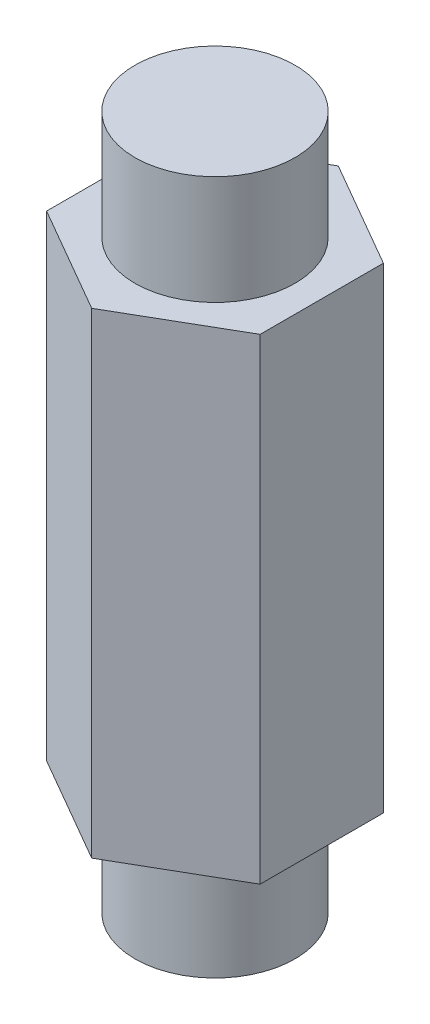
ISO-10303-21;
HEADER;
FILE_DESCRIPTION(('STEP AP214'),'2;1');
FILE_NAME('part.step','',(''),(''),'','','');
FILE_SCHEMA(('AUTOMOTIVE_DESIGN { 1 0 10303 214 1 1 1 1 }'));
ENDSEC;
DATA;
#1=APPLICATION_CONTEXT('core data for automotive mechanical design processes');
#2=APPLICATION_PROTOCOL_DEFINITION('international standard','automotive_design',2000,#1);
#3=PRODUCT_CONTEXT('',#1,'mechanical');
#4=PRODUCT('Part','Part','',(#3));
#5=PRODUCT_RELATED_PRODUCT_CATEGORY('part','',(#4));
#6=PRODUCT_DEFINITION_FORMATION('','',#4);
#7=PRODUCT_DEFINITION_CONTEXT('part definition',#1,'design');
#8=PRODUCT_DEFINITION('design','',#6,#7);
#9=PRODUCT_DEFINITION_SHAPE('','',#8);
#10=(LENGTH_UNIT() NAMED_UNIT(*) SI_UNIT(.MILLI.,.METRE.));
#11=(NAMED_UNIT(*) PLANE_ANGLE_UNIT() SI_UNIT($,.RADIAN.));
#12=(NAMED_UNIT(*) SI_UNIT($,.STERADIAN.) SOLID_ANGLE_UNIT());
#13=UNCERTAINTY_MEASURE_WITH_UNIT(LENGTH_MEASURE(1.E-05),#10,'distance_accuracy_value','');
#14=(GEOMETRIC_REPRESENTATION_CONTEXT(3) GLOBAL_UNCERTAINTY_ASSIGNED_CONTEXT((#13)) GLOBAL_UNIT_ASSIGNED_CONTEXT((#10,
#11,#12)) REPRESENTATION_CONTEXT('',''));
#15=CARTESIAN_POINT('',(0.,0.,0.));
#16=DIRECTION('',(0.,0.,1.));
#17=DIRECTION('',(1.,0.,0.));
#18=AXIS2_PLACEMENT_3D('',#15,#16,#17);
#19=CARTESIAN_POINT('',(0.,14.1605,7.33234841870825));
#20=DIRECTION('',(-0.5,0.,-0.866025403784439));
#21=DIRECTION('',(-0.866025403784439,0.,0.5));
#22=AXIS2_PLACEMENT_3D('',#19,#20,#21);
#23=PLANE('',#22);
#24=DIRECTION('',(0.866025403784438,0.,-0.5));
#25=VECTOR('',#24,1.);
#26=CARTESIAN_POINT('',(0.,-14.1605,7.33234841870825));
#27=LINE('',#26,#25);
#28=CARTESIAN_POINT('',(0.,-14.1605,7.33234841870825));
#29=VERTEX_POINT('',#28);
#30=CARTESIAN_POINT('',(6.35,-14.1605,3.66617420935412));
#31=VERTEX_POINT('',#30);
#32=EDGE_CURVE('E118',#29,#31,#27,.T.);
#33=ORIENTED_EDGE('',*,*,#32,.T.);
#34=DIRECTION('',(0.,-1.,0.));
#35=VECTOR('',#34,1.);
#36=CARTESIAN_POINT('',(6.35,14.1605,3.66617420935412));
#37=LINE('',#36,#35);
#38=CARTESIAN_POINT('',(6.35,14.1605,3.66617420935412));
#39=VERTEX_POINT('',#38);
#40=EDGE_CURVE('E41',#39,#31,#37,.T.);
#41=ORIENTED_EDGE('',*,*,#40,.F.);
#42=DIRECTION('',(0.866025403784438,0.,-0.5));
#43=VECTOR('',#42,1.);
#44=CARTESIAN_POINT('',(0.,14.1605,7.33234841870825));
#45=LINE('',#44,#43);
#46=CARTESIAN_POINT('',(0.,14.1605,7.33234841870825));
#47=VERTEX_POINT('',#46);
#48=EDGE_CURVE('E129',#47,#39,#45,.T.);
#49=ORIENTED_EDGE('',*,*,#48,.F.);
#50=DIRECTION('',(0.,-1.,0.));
#51=VECTOR('',#50,1.);
#52=CARTESIAN_POINT('',(0.,14.1605,7.33234841870825));
#53=LINE('',#52,#51);
#54=EDGE_CURVE('E114',#47,#29,#53,.T.);
#55=ORIENTED_EDGE('',*,*,#54,.T.);
#56=EDGE_LOOP('',(#33,#41,#49,#55));
#57=FACE_BOUND('',#56,.T.);
#58=ADVANCED_FACE('F33',(#57),#23,.F.);
#59=CARTESIAN_POINT('',(6.35,14.1605,3.66617420935412));
#60=DIRECTION('',(-1.,0.,0.));
#61=DIRECTION('',(0.,0.,1.));
#62=AXIS2_PLACEMENT_3D('',#59,#60,#61);
#63=PLANE('',#62);
#64=DIRECTION('',(0.,0.,-1.));
#65=VECTOR('',#64,1.);
#66=CARTESIAN_POINT('',(6.35,-14.1605,3.66617420935412));
#67=LINE('',#66,#65);
#68=CARTESIAN_POINT('',(6.35,-14.1605,-3.66617420935412));
#69=VERTEX_POINT('',#68);
#70=EDGE_CURVE('E121',#31,#69,#67,.T.);
#71=ORIENTED_EDGE('',*,*,#70,.T.);
#72=DIRECTION('',(0.,-1.,0.));
#73=VECTOR('',#72,1.);
#74=CARTESIAN_POINT('',(6.35,14.1605,-3.66617420935412));
#75=LINE('',#74,#73);
#76=CARTESIAN_POINT('',(6.35,14.1605,-3.66617420935412));
#77=VERTEX_POINT('',#76);
#78=EDGE_CURVE('E133',#77,#69,#75,.T.);
#79=ORIENTED_EDGE('',*,*,#78,.F.);
#80=DIRECTION('',(0.,0.,-1.));
#81=VECTOR('',#80,1.);
#82=CARTESIAN_POINT('',(6.35,14.1605,3.66617420935412));
#83=LINE('',#82,#81);
#84=EDGE_CURVE('E87',#39,#77,#83,.T.);
#85=ORIENTED_EDGE('',*,*,#84,.F.);
#86=ORIENTED_EDGE('',*,*,#40,.T.);
#87=EDGE_LOOP('',(#71,#79,#85,#86));
#88=FACE_BOUND('',#87,.T.);
#89=ADVANCED_FACE('F136',(#88),#63,.F.);
#90=CARTESIAN_POINT('',(6.35,14.1605,-3.66617420935412));
#91=DIRECTION('',(-0.5,0.,0.866025403784439));
#92=DIRECTION('',(0.866025403784439,0.,0.5));
#93=AXIS2_PLACEMENT_3D('',#90,#91,#92);
#94=PLANE('',#93);
#95=DIRECTION('',(-0.866025403784439,0.,-0.5));
#96=VECTOR('',#95,1.);
#97=CARTESIAN_POINT('',(6.35,-14.1605,-3.66617420935412));
#98=LINE('',#97,#96);
#99=CARTESIAN_POINT('',(0.,-14.1605,-7.33234841870825));
#100=VERTEX_POINT('',#99);
#101=EDGE_CURVE('E124',#69,#100,#98,.T.);
#102=ORIENTED_EDGE('',*,*,#101,.T.);
#103=DIRECTION('',(0.,-1.,0.));
#104=VECTOR('',#103,1.);
#105=CARTESIAN_POINT('',(0.,14.1605,-7.33234841870825));
#106=LINE('',#105,#104);
#107=CARTESIAN_POINT('',(0.,14.1605,-7.33234841870825));
#108=VERTEX_POINT('',#107);
#109=EDGE_CURVE('E109',#108,#100,#106,.T.);
#110=ORIENTED_EDGE('',*,*,#109,.F.);
#111=DIRECTION('',(-0.866025403784439,0.,-0.5));
#112=VECTOR('',#111,1.);
#113=CARTESIAN_POINT('',(6.35,14.1605,-3.66617420935412));
#114=LINE('',#113,#112);
#115=EDGE_CURVE('E100',#77,#108,#114,.T.);
#116=ORIENTED_EDGE('',*,*,#115,.F.);
#117=ORIENTED_EDGE('',*,*,#78,.T.);
#118=EDGE_LOOP('',(#102,#110,#116,#117));
#119=FACE_BOUND('',#118,.T.);
#120=ADVANCED_FACE('F144',(#119),#94,.F.);
#121=CARTESIAN_POINT('',(0.,14.1605,-7.33234841870825));
#122=DIRECTION('',(0.5,0.,0.866025403784439));
#123=DIRECTION('',(0.866025403784439,0.,-0.5));
#124=AXIS2_PLACEMENT_3D('',#121,#122,#123);
#125=PLANE('',#124);
#126=DIRECTION('',(-0.866025403784438,0.,0.5));
#127=VECTOR('',#126,1.);
#128=CARTESIAN_POINT('',(0.,-14.1605,-7.33234841870825));
#129=LINE('',#128,#127);
#130=CARTESIAN_POINT('',(-6.35,-14.1605,-3.66617420935412));
#131=VERTEX_POINT('',#130);
#132=EDGE_CURVE('E108',#100,#131,#129,.T.);
#133=ORIENTED_EDGE('',*,*,#132,.T.);
#134=DIRECTION('',(0.,-1.,0.));
#135=VECTOR('',#134,1.);
#136=CARTESIAN_POINT('',(-6.35,14.1605,-3.66617420935412));
#137=LINE('',#136,#135);
#138=CARTESIAN_POINT('',(-6.35,14.1605,-3.66617420935412));
#139=VERTEX_POINT('',#138);
#140=EDGE_CURVE('E105',#139,#131,#137,.T.);
#141=ORIENTED_EDGE('',*,*,#140,.F.);
#142=DIRECTION('',(-0.866025403784438,0.,0.5));
#143=VECTOR('',#142,1.);
#144=CARTESIAN_POINT('',(0.,14.1605,-7.33234841870825));
#145=LINE('',#144,#143);
#146=EDGE_CURVE('E94',#108,#139,#145,.T.);
#147=ORIENTED_EDGE('',*,*,#146,.F.);
#148=ORIENTED_EDGE('',*,*,#109,.T.);
#149=EDGE_LOOP('',(#133,#141,#147,#148));
#150=FACE_BOUND('',#149,.T.);
#151=ADVANCED_FACE('F106',(#150),#125,.F.);
#152=CARTESIAN_POINT('',(-6.35,14.1605,-3.66617420935412));
#153=DIRECTION('',(1.,0.,0.));
#154=DIRECTION('',(0.,0.,-1.));
#155=AXIS2_PLACEMENT_3D('',#152,#153,#154);
#156=PLANE('',#155);
#157=DIRECTION('',(0.,0.,1.));
#158=VECTOR('',#157,1.);
#159=CARTESIAN_POINT('',(-6.35,-14.1605,-3.66617420935412));
#160=LINE('',#159,#158);
#161=CARTESIAN_POINT('',(-6.35,-14.1605,3.66617420935412));
#162=VERTEX_POINT('',#161);
#163=EDGE_CURVE('E72',#131,#162,#160,.T.);
#164=ORIENTED_EDGE('',*,*,#163,.T.);
#165=DIRECTION('',(0.,-1.,0.));
#166=VECTOR('',#165,1.);
#167=CARTESIAN_POINT('',(-6.35,14.1605,3.66617420935412));
#168=LINE('',#167,#166);
#169=CARTESIAN_POINT('',(-6.35,14.1605,3.66617420935412));
#170=VERTEX_POINT('',#169);
#171=EDGE_CURVE('E110',#170,#162,#168,.T.);
#172=ORIENTED_EDGE('',*,*,#171,.F.);
#173=DIRECTION('',(0.,0.,1.));
#174=VECTOR('',#173,1.);
#175=CARTESIAN_POINT('',(-6.35,14.1605,-3.66617420935412));
#176=LINE('',#175,#174);
#177=EDGE_CURVE('E98',#139,#170,#176,.T.);
#178=ORIENTED_EDGE('',*,*,#177,.F.);
#179=ORIENTED_EDGE('',*,*,#140,.T.);
#180=EDGE_LOOP('',(#164,#172,#178,#179));
#181=FACE_BOUND('',#180,.T.);
#182=ADVANCED_FACE('F112',(#181),#156,.F.);
#183=CARTESIAN_POINT('',(-6.35,14.1605,3.66617420935412));
#184=DIRECTION('',(0.5,0.,-0.866025403784439));
#185=DIRECTION('',(-0.866025403784439,0.,-0.5));
#186=AXIS2_PLACEMENT_3D('',#183,#184,#185);
#187=PLANE('',#186);
#188=DIRECTION('',(0.866025403784439,0.,0.5));
#189=VECTOR('',#188,1.);
#190=CARTESIAN_POINT('',(-6.35,-14.1605,3.66617420935412));
#191=LINE('',#190,#189);
#192=EDGE_CURVE('E78',#162,#29,#191,.T.);
#193=ORIENTED_EDGE('',*,*,#192,.T.);
#194=ORIENTED_EDGE('',*,*,#54,.F.);
#195=DIRECTION('',(0.866025403784439,0.,0.5));
#196=VECTOR('',#195,1.);
#197=CARTESIAN_POINT('',(-6.35,14.1605,3.66617420935412));
#198=LINE('',#197,#196);
#199=EDGE_CURVE('E49',#170,#47,#198,.T.);
#200=ORIENTED_EDGE('',*,*,#199,.F.);
#201=ORIENTED_EDGE('',*,*,#171,.T.);
#202=EDGE_LOOP('',(#193,#194,#200,#201));
#203=FACE_BOUND('',#202,.T.);
#204=ADVANCED_FACE('F187',(#203),#187,.F.);
#205=CARTESIAN_POINT('',(0.,14.1605,0.));
#206=DIRECTION('',(0.,1.,0.));
#207=DIRECTION('',(0.,0.,1.));
#208=AXIS2_PLACEMENT_3D('',#205,#206,#207);
#209=PLANE('',#208);
#210=CARTESIAN_POINT('',(0.,14.1605,0.));
#211=DIRECTION('',(0.,1.,0.));
#212=DIRECTION('',(0.,0.,1.));
#213=AXIS2_PLACEMENT_3D('',#210,#211,#212);
#214=CIRCLE('',#213,4.7625);
#215=CARTESIAN_POINT('',(0.,14.1605,4.7625));
#216=VERTEX_POINT('',#215);
#217=EDGE_CURVE('E122',#216,#216,#214,.F.);
#218=ORIENTED_EDGE('',*,*,#217,.T.);
#219=EDGE_LOOP('',(#218));
#220=FACE_BOUND('',#219,.T.);
#221=ORIENTED_EDGE('',*,*,#48,.T.);
#222=ORIENTED_EDGE('',*,*,#84,.T.);
#223=ORIENTED_EDGE('',*,*,#115,.T.);
#224=ORIENTED_EDGE('',*,*,#146,.T.);
#225=ORIENTED_EDGE('',*,*,#177,.T.);
#226=ORIENTED_EDGE('',*,*,#199,.T.);
#227=EDGE_LOOP('',(#221,#222,#223,#224,#225,#226));
#228=FACE_BOUND('',#227,.T.);
#229=ADVANCED_FACE('F96',(#220,#228),#209,.T.);
#230=CARTESIAN_POINT('',(0.,-14.1605,0.));
#231=DIRECTION('',(0.,1.,0.));
#232=DIRECTION('',(0.,0.,1.));
#233=AXIS2_PLACEMENT_3D('',#230,#231,#232);
#234=PLANE('',#233);
#235=CARTESIAN_POINT('',(0.,-14.1605,0.));
#236=DIRECTION('',(0.,1.,0.));
#237=DIRECTION('',(0.,0.,1.));
#238=AXIS2_PLACEMENT_3D('',#235,#236,#237);
#239=CIRCLE('',#238,4.7625);
#240=CARTESIAN_POINT('',(0.,-14.1605,4.7625));
#241=VERTEX_POINT('',#240);
#242=EDGE_CURVE('E11',#241,#241,#239,.F.);
#243=ORIENTED_EDGE('',*,*,#242,.F.);
#244=EDGE_LOOP('',(#243));
#245=FACE_BOUND('',#244,.T.);
#246=ORIENTED_EDGE('',*,*,#32,.F.);
#247=ORIENTED_EDGE('',*,*,#192,.F.);
#248=ORIENTED_EDGE('',*,*,#163,.F.);
#249=ORIENTED_EDGE('',*,*,#132,.F.);
#250=ORIENTED_EDGE('',*,*,#101,.F.);
#251=ORIENTED_EDGE('',*,*,#70,.F.);
#252=EDGE_LOOP('',(#246,#247,#248,#249,#250,#251));
#253=FACE_BOUND('',#252,.T.);
#254=ADVANCED_FACE('F141',(#245,#253),#234,.F.);
#255=CARTESIAN_POINT('',(0.,-20.6375,0.));
#256=DIRECTION('',(0.,1.,0.));
#257=DIRECTION('',(0.,0.,1.));
#258=AXIS2_PLACEMENT_3D('',#255,#256,#257);
#259=PLANE('',#258);
#260=CARTESIAN_POINT('',(0.,-20.6375,0.));
#261=DIRECTION('',(0.,1.,0.));
#262=DIRECTION('',(0.,0.,1.));
#263=AXIS2_PLACEMENT_3D('',#260,#261,#262);
#264=CIRCLE('',#263,4.7625);
#265=CARTESIAN_POINT('',(0.,-20.6375,4.7625));
#266=VERTEX_POINT('',#265);
#267=EDGE_CURVE('E151',#266,#266,#264,.T.);
#268=ORIENTED_EDGE('',*,*,#267,.F.);
#269=EDGE_LOOP('',(#268));
#270=FACE_BOUND('',#269,.T.);
#271=ADVANCED_FACE('F169',(#270),#259,.F.);
#272=CARTESIAN_POINT('',(0.,20.6375,0.));
#273=DIRECTION('',(0.,-1.,0.));
#274=DIRECTION('',(0.,0.,-1.));
#275=AXIS2_PLACEMENT_3D('',#272,#273,#274);
#276=CYLINDRICAL_SURFACE('',#275,4.7625);
#277=ORIENTED_EDGE('',*,*,#267,.T.);
#278=EDGE_LOOP('',(#277));
#279=FACE_BOUND('',#278,.T.);
#280=ORIENTED_EDGE('',*,*,#242,.T.);
#281=EDGE_LOOP('',(#280));
#282=FACE_BOUND('',#281,.T.);
#283=ADVANCED_FACE('F161',(#279,#282),#276,.T.);
#284=ORIENTED_EDGE('',*,*,#217,.F.);
#285=EDGE_LOOP('',(#284));
#286=FACE_BOUND('',#285,.T.);
#287=CARTESIAN_POINT('',(0.,20.6375,0.));
#288=DIRECTION('',(0.,1.,0.));
#289=DIRECTION('',(0.,0.,1.));
#290=AXIS2_PLACEMENT_3D('',#287,#288,#289);
#291=CIRCLE('',#290,4.7625);
#292=CARTESIAN_POINT('',(0.,20.6375,4.7625));
#293=VERTEX_POINT('',#292);
#294=EDGE_CURVE('E150',#293,#293,#291,.T.);
#295=ORIENTED_EDGE('',*,*,#294,.F.);
#296=EDGE_LOOP('',(#295));
#297=FACE_BOUND('',#296,.T.);
#298=ADVANCED_FACE('F159',(#286,#297),#276,.T.);
#299=CARTESIAN_POINT('',(0.,20.6375,0.));
#300=DIRECTION('',(0.,1.,0.));
#301=DIRECTION('',(0.,0.,1.));
#302=AXIS2_PLACEMENT_3D('',#299,#300,#301);
#303=PLANE('',#302);
#304=ORIENTED_EDGE('',*,*,#294,.T.);
#305=EDGE_LOOP('',(#304));
#306=FACE_BOUND('',#305,.T.);
#307=ADVANCED_FACE('F157',(#306),#303,.T.);
#308=CLOSED_SHELL('',(#58,#89,#120,#151,#182,#204,#229,#254,#271,#283,#298,#307));
#309=MANIFOLD_SOLID_BREP('B2',#308);
#310=ADVANCED_BREP_SHAPE_REPRESENTATION('',(#18,#309),#14);
#311=SHAPE_DEFINITION_REPRESENTATION(#9,#310);
ENDSEC;
END-ISO-10303-21;
